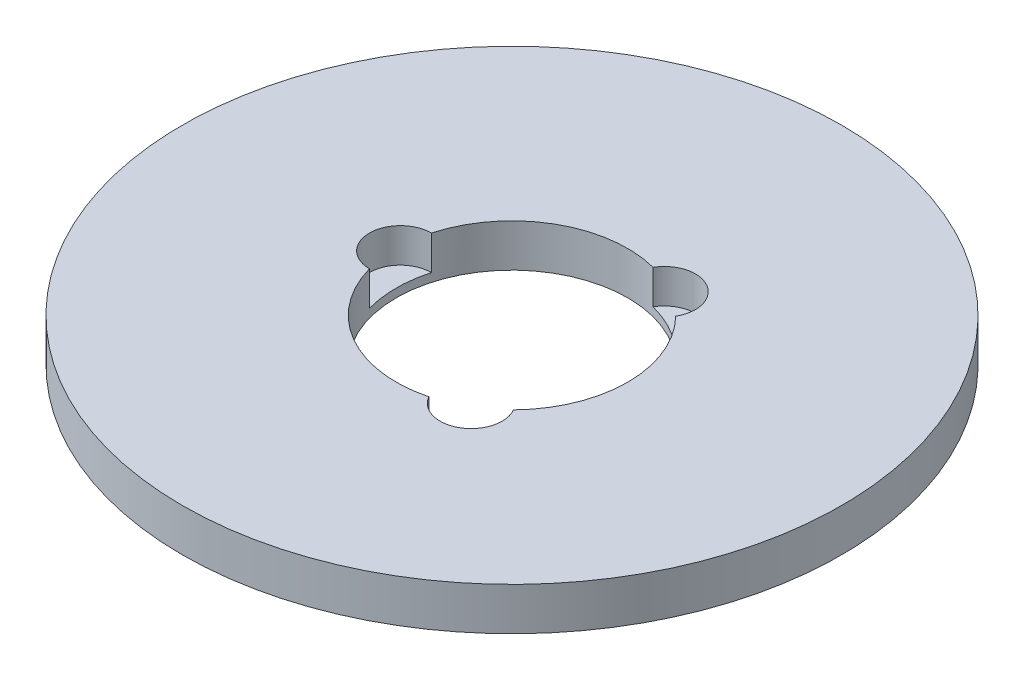
ISO-10303-21;
HEADER;
FILE_DESCRIPTION(('STEP AP214'),'2;1');
FILE_NAME('part.step','',(''),(''),'','','');
FILE_SCHEMA(('AUTOMOTIVE_DESIGN { 1 0 10303 214 1 1 1 1 }'));
ENDSEC;
DATA;
#1=APPLICATION_CONTEXT('core data for automotive mechanical design processes');
#2=APPLICATION_PROTOCOL_DEFINITION('international standard','automotive_design',2000,#1);
#3=PRODUCT_CONTEXT('',#1,'mechanical');
#4=PRODUCT('Part','Part','',(#3));
#5=PRODUCT_RELATED_PRODUCT_CATEGORY('part','',(#4));
#6=PRODUCT_DEFINITION_FORMATION('','',#4);
#7=PRODUCT_DEFINITION_CONTEXT('part definition',#1,'design');
#8=PRODUCT_DEFINITION('design','',#6,#7);
#9=PRODUCT_DEFINITION_SHAPE('','',#8);
#10=(LENGTH_UNIT() NAMED_UNIT(*) SI_UNIT(.MILLI.,.METRE.));
#11=(NAMED_UNIT(*) PLANE_ANGLE_UNIT() SI_UNIT($,.RADIAN.));
#12=(NAMED_UNIT(*) SI_UNIT($,.STERADIAN.) SOLID_ANGLE_UNIT());
#13=UNCERTAINTY_MEASURE_WITH_UNIT(LENGTH_MEASURE(1.E-05),#10,'distance_accuracy_value','');
#14=(GEOMETRIC_REPRESENTATION_CONTEXT(3) GLOBAL_UNCERTAINTY_ASSIGNED_CONTEXT((#13)) GLOBAL_UNIT_ASSIGNED_CONTEXT((#10,
#11,#12)) REPRESENTATION_CONTEXT('',''));
#15=CARTESIAN_POINT('',(0.,0.,0.));
#16=DIRECTION('',(0.,0.,1.));
#17=DIRECTION('',(1.,0.,0.));
#18=AXIS2_PLACEMENT_3D('',#15,#16,#17);
#19=CARTESIAN_POINT('',(0.,12.,0.));
#20=DIRECTION('',(0.,-1.,0.));
#21=DIRECTION('',(0.,0.,-1.));
#22=AXIS2_PLACEMENT_3D('',#19,#20,#21);
#23=CYLINDRICAL_SURFACE('',#22,92.5);
#24=CARTESIAN_POINT('',(0.,12.,0.));
#25=DIRECTION('',(0.,1.,0.));
#26=DIRECTION('',(0.,0.,1.));
#27=AXIS2_PLACEMENT_3D('',#24,#25,#26);
#28=CIRCLE('',#27,92.5);
#29=CARTESIAN_POINT('',(0.,12.,92.5));
#30=VERTEX_POINT('',#29);
#31=EDGE_CURVE('E126',#30,#30,#28,.T.);
#32=ORIENTED_EDGE('',*,*,#31,.F.);
#33=EDGE_LOOP('',(#32));
#34=FACE_BOUND('',#33,.T.);
#35=CARTESIAN_POINT('',(0.,0.,0.));
#36=DIRECTION('',(0.,1.,0.));
#37=DIRECTION('',(0.,0.,1.));
#38=AXIS2_PLACEMENT_3D('',#35,#36,#37);
#39=CIRCLE('',#38,92.5);
#40=CARTESIAN_POINT('',(0.,0.,92.5));
#41=VERTEX_POINT('',#40);
#42=EDGE_CURVE('E124',#41,#41,#39,.T.);
#43=ORIENTED_EDGE('',*,*,#42,.T.);
#44=EDGE_LOOP('',(#43));
#45=FACE_BOUND('',#44,.T.);
#46=ADVANCED_FACE('F39',(#34,#45),#23,.T.);
#47=CARTESIAN_POINT('',(0.,12.,0.));
#48=DIRECTION('',(0.,1.,0.));
#49=DIRECTION('',(0.,0.,1.));
#50=AXIS2_PLACEMENT_3D('',#47,#48,#49);
#51=PLANE('',#50);
#52=CARTESIAN_POINT('',(15.6610933985788,12.,27.1258094684197));
#53=DIRECTION('',(0.,1.,0.));
#54=DIRECTION('',(0.866025403784436,0.,-0.500000000000004));
#55=AXIS2_PLACEMENT_3D('',#52,#53,#54);
#56=CIRCLE('',#55,8.692751427458);
#57=CARTESIAN_POINT('',(8.12981254375128,12.,31.4667467019307));
#58=VERTEX_POINT('',#57);
#59=CARTESIAN_POINT('',(23.1860957464467,12.,22.7739975418591));
#60=VERTEX_POINT('',#59);
#61=EDGE_CURVE('E147',#58,#60,#56,.T.);
#62=ORIENTED_EDGE('',*,*,#61,.F.);
#63=CARTESIAN_POINT('',(0.,12.,0.));
#64=DIRECTION('',(0.,1.,0.));
#65=DIRECTION('',(0.,0.,1.));
#66=AXIS2_PLACEMENT_3D('',#63,#64,#65);
#67=CIRCLE('',#66,32.5);
#68=CARTESIAN_POINT('',(-31.3159082901978,12.,8.69274916007148));
#69=VERTEX_POINT('',#68);
#70=EDGE_CURVE('E118',#69,#58,#67,.T.);
#71=ORIENTED_EDGE('',*,*,#70,.F.);
#72=CARTESIAN_POINT('',(-31.3221867971573,12.,0.));
#73=DIRECTION('',(0.,1.,0.));
#74=DIRECTION('',(0.,0.,1.));
#75=AXIS2_PLACEMENT_3D('',#72,#73,#74);
#76=CIRCLE('',#75,8.692751427458);
#77=CARTESIAN_POINT('',(-31.3159082901978,12.,-8.69274916007148));
#78=VERTEX_POINT('',#77);
#79=EDGE_CURVE('E113',#78,#69,#76,.T.);
#80=ORIENTED_EDGE('',*,*,#79,.F.);
#81=CARTESIAN_POINT('',(8.12981254375084,12.,-31.4667467019308));
#82=VERTEX_POINT('',#81);
#83=EDGE_CURVE('E106',#82,#78,#67,.T.);
#84=ORIENTED_EDGE('',*,*,#83,.F.);
#85=CARTESIAN_POINT('',(15.6610933985784,12.,-27.1258094684199));
#86=DIRECTION('',(0.,1.,0.));
#87=DIRECTION('',(-0.866025403784443,0.,-0.499999999999992));
#88=AXIS2_PLACEMENT_3D('',#85,#86,#87);
#89=CIRCLE('',#88,8.692751427458);
#90=CARTESIAN_POINT('',(23.1860957464464,12.,-22.7739975418594));
#91=VERTEX_POINT('',#90);
#92=EDGE_CURVE('E90',#91,#82,#89,.T.);
#93=ORIENTED_EDGE('',*,*,#92,.F.);
#94=EDGE_CURVE('E116',#60,#91,#67,.T.);
#95=ORIENTED_EDGE('',*,*,#94,.F.);
#96=EDGE_LOOP('',(#62,#71,#80,#84,#93,#95));
#97=FACE_BOUND('',#96,.T.);
#98=ORIENTED_EDGE('',*,*,#31,.T.);
#99=EDGE_LOOP('',(#98));
#100=FACE_BOUND('',#99,.T.);
#101=ADVANCED_FACE('F115',(#97,#100),#51,.T.);
#102=CARTESIAN_POINT('',(0.,0.,0.));
#103=DIRECTION('',(0.,1.,0.));
#104=DIRECTION('',(0.,0.,1.));
#105=AXIS2_PLACEMENT_3D('',#102,#103,#104);
#106=PLANE('',#105);
#107=CARTESIAN_POINT('',(0.,0.,0.));
#108=DIRECTION('',(0.,1.,0.));
#109=DIRECTION('',(0.,0.,1.));
#110=AXIS2_PLACEMENT_3D('',#107,#108,#109);
#111=CIRCLE('',#110,32.5);
#112=CARTESIAN_POINT('',(0.,0.,32.5));
#113=VERTEX_POINT('',#112);
#114=EDGE_CURVE('E120',#113,#113,#111,.T.);
#115=ORIENTED_EDGE('',*,*,#114,.T.);
#116=EDGE_LOOP('',(#115));
#117=FACE_BOUND('',#116,.T.);
#118=ORIENTED_EDGE('',*,*,#42,.F.);
#119=EDGE_LOOP('',(#118));
#120=FACE_BOUND('',#119,.T.);
#121=ADVANCED_FACE('F164',(#117,#120),#106,.F.);
#122=CARTESIAN_POINT('',(0.,12.,0.));
#123=DIRECTION('',(0.,-1.,0.));
#124=DIRECTION('',(0.,0.,-1.));
#125=AXIS2_PLACEMENT_3D('',#122,#123,#124);
#126=CYLINDRICAL_SURFACE('',#125,32.5);
#127=DIRECTION('',(0.,1.,0.));
#128=VECTOR('',#127,1.);
#129=CARTESIAN_POINT('',(8.12981254375128,7.19485171253152,31.4667467019307));
#130=LINE('',#129,#128);
#131=CARTESIAN_POINT('',(8.12981254375128,2.38970342506303,31.4667467019307));
#132=VERTEX_POINT('',#131);
#133=EDGE_CURVE('E11',#132,#58,#130,.T.);
#134=ORIENTED_EDGE('',*,*,#133,.F.);
#135=CARTESIAN_POINT('',(0.,2.38970342506303,0.));
#136=DIRECTION('',(0.,1.,0.));
#137=DIRECTION('',(0.,0.,1.));
#138=AXIS2_PLACEMENT_3D('',#135,#136,#137);
#139=CIRCLE('',#138,32.5);
#140=CARTESIAN_POINT('',(23.1860957464467,2.38970342506303,22.7739975418591));
#141=VERTEX_POINT('',#140);
#142=EDGE_CURVE('E144',#132,#141,#139,.T.);
#143=ORIENTED_EDGE('',*,*,#142,.T.);
#144=DIRECTION('',(0.,1.,0.));
#145=VECTOR('',#144,1.);
#146=CARTESIAN_POINT('',(23.1860957464467,7.19485171253152,22.7739975418591));
#147=LINE('',#146,#145);
#148=EDGE_CURVE('E46',#60,#141,#147,.F.);
#149=ORIENTED_EDGE('',*,*,#148,.F.);
#150=ORIENTED_EDGE('',*,*,#94,.T.);
#151=DIRECTION('',(0.,1.,0.));
#152=VECTOR('',#151,1.);
#153=CARTESIAN_POINT('',(23.1860957464464,7.19485171253152,-22.7739975418594));
#154=LINE('',#153,#152);
#155=CARTESIAN_POINT('',(23.1860957464464,2.38970342506303,-22.7739975418594));
#156=VERTEX_POINT('',#155);
#157=EDGE_CURVE('E92',#156,#91,#154,.T.);
#158=ORIENTED_EDGE('',*,*,#157,.F.);
#159=CARTESIAN_POINT('',(0.,2.38970342506303,0.));
#160=DIRECTION('',(0.,1.,0.));
#161=DIRECTION('',(0.,0.,1.));
#162=AXIS2_PLACEMENT_3D('',#159,#160,#161);
#163=CIRCLE('',#162,32.5);
#164=CARTESIAN_POINT('',(8.12981254375084,2.38970342506303,-31.4667467019308));
#165=VERTEX_POINT('',#164);
#166=EDGE_CURVE('E107',#156,#165,#163,.T.);
#167=ORIENTED_EDGE('',*,*,#166,.T.);
#168=DIRECTION('',(0.,1.,0.));
#169=VECTOR('',#168,1.);
#170=CARTESIAN_POINT('',(8.12981254375084,7.19485171253152,-31.4667467019308));
#171=LINE('',#170,#169);
#172=EDGE_CURVE('E95',#82,#165,#171,.F.);
#173=ORIENTED_EDGE('',*,*,#172,.F.);
#174=ORIENTED_EDGE('',*,*,#83,.T.);
#175=DIRECTION('',(0.,1.,0.));
#176=VECTOR('',#175,1.);
#177=CARTESIAN_POINT('',(-31.3159082901978,7.19485171253152,-8.69274916007148));
#178=LINE('',#177,#176);
#179=CARTESIAN_POINT('',(-31.3159082901978,2.38970342506303,-8.69274916007148));
#180=VERTEX_POINT('',#179);
#181=EDGE_CURVE('E143',#180,#78,#178,.T.);
#182=ORIENTED_EDGE('',*,*,#181,.F.);
#183=CARTESIAN_POINT('',(0.,2.38970342506303,0.));
#184=DIRECTION('',(0.,1.,0.));
#185=DIRECTION('',(0.,0.,1.));
#186=AXIS2_PLACEMENT_3D('',#183,#184,#185);
#187=CIRCLE('',#186,32.5);
#188=CARTESIAN_POINT('',(-31.3159082901978,2.38970342506303,8.69274916007148));
#189=VERTEX_POINT('',#188);
#190=EDGE_CURVE('E132',#180,#189,#187,.T.);
#191=ORIENTED_EDGE('',*,*,#190,.T.);
#192=DIRECTION('',(0.,1.,0.));
#193=VECTOR('',#192,1.);
#194=CARTESIAN_POINT('',(-31.3159082901978,7.19485171253152,8.69274916007148));
#195=LINE('',#194,#193);
#196=EDGE_CURVE('E137',#69,#189,#195,.F.);
#197=ORIENTED_EDGE('',*,*,#196,.F.);
#198=ORIENTED_EDGE('',*,*,#70,.T.);
#199=EDGE_LOOP('',(#134,#143,#149,#150,#158,#167,#173,#174,#182,#191,#197,#198));
#200=FACE_BOUND('',#199,.T.);
#201=ORIENTED_EDGE('',*,*,#114,.F.);
#202=EDGE_LOOP('',(#201));
#203=FACE_BOUND('',#202,.T.);
#204=ADVANCED_FACE('F103',(#200,#203),#126,.F.);
#205=CARTESIAN_POINT('',(-31.3221867971573,2.38970342506303,0.));
#206=DIRECTION('',(0.,1.,0.));
#207=DIRECTION('',(0.,0.,1.));
#208=AXIS2_PLACEMENT_3D('',#205,#206,#207);
#209=CYLINDRICAL_SURFACE('',#208,8.692751427458);
#210=ORIENTED_EDGE('',*,*,#181,.T.);
#211=ORIENTED_EDGE('',*,*,#79,.T.);
#212=ORIENTED_EDGE('',*,*,#196,.T.);
#213=CARTESIAN_POINT('',(-31.3221867971573,2.38970342506303,0.));
#214=DIRECTION('',(0.,1.,0.));
#215=DIRECTION('',(0.,0.,1.));
#216=AXIS2_PLACEMENT_3D('',#213,#214,#215);
#217=CIRCLE('',#216,8.692751427458);
#218=EDGE_CURVE('E121',#180,#189,#217,.T.);
#219=ORIENTED_EDGE('',*,*,#218,.F.);
#220=EDGE_LOOP('',(#210,#211,#212,#219));
#221=FACE_BOUND('',#220,.T.);
#222=ADVANCED_FACE('F174',(#221),#209,.F.);
#223=CARTESIAN_POINT('',(-31.3221867971573,2.38970342506303,0.));
#224=DIRECTION('',(0.,1.,0.));
#225=DIRECTION('',(0.,0.,1.));
#226=AXIS2_PLACEMENT_3D('',#223,#224,#225);
#227=PLANE('',#226);
#228=ORIENTED_EDGE('',*,*,#218,.T.);
#229=ORIENTED_EDGE('',*,*,#190,.F.);
#230=EDGE_LOOP('',(#228,#229));
#231=FACE_BOUND('',#230,.T.);
#232=ADVANCED_FACE('F177',(#231),#227,.T.);
#233=CARTESIAN_POINT('',(15.6610933985784,2.38970342506303,-27.1258094684199));
#234=DIRECTION('',(0.,1.,0.));
#235=DIRECTION('',(0.,0.,1.));
#236=AXIS2_PLACEMENT_3D('',#233,#234,#235);
#237=CYLINDRICAL_SURFACE('',#236,8.692751427458);
#238=ORIENTED_EDGE('',*,*,#157,.T.);
#239=ORIENTED_EDGE('',*,*,#92,.T.);
#240=ORIENTED_EDGE('',*,*,#172,.T.);
#241=CARTESIAN_POINT('',(15.6610933985784,2.38970342506303,-27.1258094684199));
#242=DIRECTION('',(0.,1.,0.));
#243=DIRECTION('',(-0.866025403784443,0.,-0.499999999999992));
#244=AXIS2_PLACEMENT_3D('',#241,#242,#243);
#245=CIRCLE('',#244,8.692751427458);
#246=EDGE_CURVE('E56',#156,#165,#245,.T.);
#247=ORIENTED_EDGE('',*,*,#246,.F.);
#248=EDGE_LOOP('',(#238,#239,#240,#247));
#249=FACE_BOUND('',#248,.T.);
#250=ADVANCED_FACE('F93',(#249),#237,.F.);
#251=CARTESIAN_POINT('',(15.6610933985784,2.38970342506303,-27.1258094684199));
#252=DIRECTION('',(0.,1.,0.));
#253=DIRECTION('',(-0.866025403784443,0.,-0.499999999999992));
#254=AXIS2_PLACEMENT_3D('',#251,#252,#253);
#255=PLANE('',#254);
#256=ORIENTED_EDGE('',*,*,#246,.T.);
#257=ORIENTED_EDGE('',*,*,#166,.F.);
#258=EDGE_LOOP('',(#256,#257));
#259=FACE_BOUND('',#258,.T.);
#260=ADVANCED_FACE('F160',(#259),#255,.T.);
#261=CARTESIAN_POINT('',(15.6610933985788,2.38970342506303,27.1258094684197));
#262=DIRECTION('',(0.,1.,0.));
#263=DIRECTION('',(0.,0.,1.));
#264=AXIS2_PLACEMENT_3D('',#261,#262,#263);
#265=CYLINDRICAL_SURFACE('',#264,8.692751427458);
#266=ORIENTED_EDGE('',*,*,#133,.T.);
#267=ORIENTED_EDGE('',*,*,#61,.T.);
#268=ORIENTED_EDGE('',*,*,#148,.T.);
#269=CARTESIAN_POINT('',(15.6610933985788,2.38970342506303,27.1258094684197));
#270=DIRECTION('',(0.,1.,0.));
#271=DIRECTION('',(0.866025403784436,0.,-0.500000000000004));
#272=AXIS2_PLACEMENT_3D('',#269,#270,#271);
#273=CIRCLE('',#272,8.692751427458);
#274=EDGE_CURVE('E55',#132,#141,#273,.T.);
#275=ORIENTED_EDGE('',*,*,#274,.F.);
#276=EDGE_LOOP('',(#266,#267,#268,#275));
#277=FACE_BOUND('',#276,.T.);
#278=ADVANCED_FACE('F149',(#277),#265,.F.);
#279=CARTESIAN_POINT('',(15.6610933985788,2.38970342506303,27.1258094684197));
#280=DIRECTION('',(0.,1.,0.));
#281=DIRECTION('',(0.866025403784436,0.,-0.500000000000004));
#282=AXIS2_PLACEMENT_3D('',#279,#280,#281);
#283=PLANE('',#282);
#284=ORIENTED_EDGE('',*,*,#274,.T.);
#285=ORIENTED_EDGE('',*,*,#142,.F.);
#286=EDGE_LOOP('',(#284,#285));
#287=FACE_BOUND('',#286,.T.);
#288=ADVANCED_FACE('F151',(#287),#283,.T.);
#289=CLOSED_SHELL('',(#46,#101,#121,#204,#222,#232,#250,#260,#278,#288));
#290=MANIFOLD_SOLID_BREP('B2',#289);
#291=ADVANCED_BREP_SHAPE_REPRESENTATION('',(#18,#290),#14);
#292=SHAPE_DEFINITION_REPRESENTATION(#9,#291);
ENDSEC;
END-ISO-10303-21;
